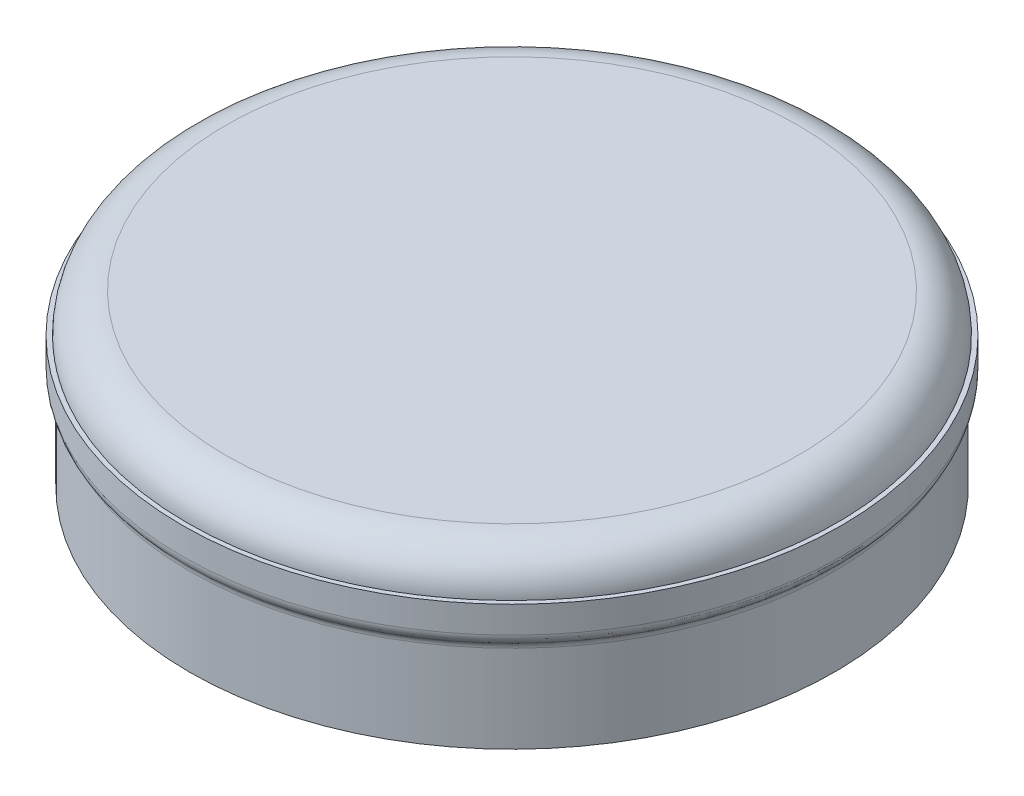
ISO-10303-21;
HEADER;
FILE_DESCRIPTION(('STEP AP214'),'2;1');
FILE_NAME('part.step','',(''),(''),'','','');
FILE_SCHEMA(('AUTOMOTIVE_DESIGN { 1 0 10303 214 1 1 1 1 }'));
ENDSEC;
DATA;
#1=APPLICATION_CONTEXT('core data for automotive mechanical design processes');
#2=APPLICATION_PROTOCOL_DEFINITION('international standard','automotive_design',2000,#1);
#3=PRODUCT_CONTEXT('',#1,'mechanical');
#4=PRODUCT('Part','Part','',(#3));
#5=PRODUCT_RELATED_PRODUCT_CATEGORY('part','',(#4));
#6=PRODUCT_DEFINITION_FORMATION('','',#4);
#7=PRODUCT_DEFINITION_CONTEXT('part definition',#1,'design');
#8=PRODUCT_DEFINITION('design','',#6,#7);
#9=PRODUCT_DEFINITION_SHAPE('','',#8);
#10=(LENGTH_UNIT() NAMED_UNIT(*) SI_UNIT(.MILLI.,.METRE.));
#11=(NAMED_UNIT(*) PLANE_ANGLE_UNIT() SI_UNIT($,.RADIAN.));
#12=(NAMED_UNIT(*) SI_UNIT($,.STERADIAN.) SOLID_ANGLE_UNIT());
#13=UNCERTAINTY_MEASURE_WITH_UNIT(LENGTH_MEASURE(1.E-05),#10,'distance_accuracy_value','');
#14=(GEOMETRIC_REPRESENTATION_CONTEXT(3) GLOBAL_UNCERTAINTY_ASSIGNED_CONTEXT((#13)) GLOBAL_UNIT_ASSIGNED_CONTEXT((#10,
#11,#12)) REPRESENTATION_CONTEXT('',''));
#15=CARTESIAN_POINT('',(0.,0.,0.));
#16=DIRECTION('',(0.,0.,1.));
#17=DIRECTION('',(1.,0.,0.));
#18=AXIS2_PLACEMENT_3D('',#15,#16,#17);
#19=CARTESIAN_POINT('',(0.,0.,0.));
#20=DIRECTION('',(0.,1.,0.));
#21=DIRECTION('',(0.,0.,1.));
#22=AXIS2_PLACEMENT_3D('',#19,#20,#21);
#23=CYLINDRICAL_SURFACE('',#22,9.017);
#24=CARTESIAN_POINT('',(0.,-1.82256044475423,0.));
#25=DIRECTION('',(0.,1.,0.));
#26=DIRECTION('',(0.,0.,1.));
#27=AXIS2_PLACEMENT_3D('',#24,#25,#26);
#28=CIRCLE('',#27,9.017);
#29=CARTESIAN_POINT('',(0.,-1.82256044475423,9.017));
#30=VERTEX_POINT('',#29);
#31=EDGE_CURVE('P0_E75',#30,#30,#28,.F.);
#32=ORIENTED_EDGE('',*,*,#31,.T.);
#33=EDGE_LOOP('',(#32));
#34=FACE_BOUND('',#33,.T.);
#35=CARTESIAN_POINT('',(0.,-1.0795,0.));
#36=DIRECTION('',(0.,1.,0.));
#37=DIRECTION('',(0.,0.,1.));
#38=AXIS2_PLACEMENT_3D('',#35,#36,#37);
#39=CIRCLE('',#38,9.017);
#40=CARTESIAN_POINT('',(0.,-1.0795,9.017));
#41=VERTEX_POINT('',#40);
#42=EDGE_CURVE('P0_E17',#41,#41,#39,.T.);
#43=ORIENTED_EDGE('',*,*,#42,.T.);
#44=EDGE_LOOP('',(#43));
#45=FACE_BOUND('',#44,.T.);
#46=ADVANCED_FACE('P0_F14',(#34,#45),#23,.F.);
#47=CARTESIAN_POINT('',(0.,-1.82256044475423,0.));
#48=DIRECTION('',(0.,1.,0.));
#49=DIRECTION('',(0.,0.,1.));
#50=AXIS2_PLACEMENT_3D('',#47,#48,#49);
#51=TOROIDAL_SURFACE('',#50,8.763,0.254000000000002);
#52=CARTESIAN_POINT('',(0.,-2.02238605942635,0.));
#53=DIRECTION('',(0.,1.,0.));
#54=DIRECTION('',(0.,0.,1.));
#55=AXIS2_PLACEMENT_3D('',#52,#53,#54);
#56=CIRCLE('',#55,8.91979835369324);
#57=CARTESIAN_POINT('',(0.,-2.02238605942635,8.91979835369324));
#58=VERTEX_POINT('',#57);
#59=EDGE_CURVE('P0_E74',#58,#58,#56,.T.);
#60=ORIENTED_EDGE('',*,*,#59,.F.);
#61=EDGE_LOOP('',(#60));
#62=FACE_BOUND('',#61,.T.);
#63=ORIENTED_EDGE('',*,*,#31,.F.);
#64=EDGE_LOOP('',(#63));
#65=FACE_BOUND('',#64,.T.);
#66=ADVANCED_FACE('P0_F67',(#62,#65),#51,.F.);
#67=CARTESIAN_POINT('',(0.,-1.0795,9.144));
#68=DIRECTION('',(0.,-1.,0.));
#69=DIRECTION('',(0.,0.,-1.));
#70=AXIS2_PLACEMENT_3D('',#67,#68,#69);
#71=PLANE('',#70);
#72=CARTESIAN_POINT('',(0.,-1.0795,0.));
#73=DIRECTION('',(0.,1.,0.));
#74=DIRECTION('',(0.,0.,1.));
#75=AXIS2_PLACEMENT_3D('',#72,#73,#74);
#76=CIRCLE('',#75,9.144);
#77=CARTESIAN_POINT('',(0.,-1.0795,9.144));
#78=VERTEX_POINT('',#77);
#79=EDGE_CURVE('P0_E55',#78,#78,#76,.F.);
#80=ORIENTED_EDGE('',*,*,#79,.F.);
#81=EDGE_LOOP('',(#80));
#82=FACE_BOUND('',#81,.T.);
#83=ORIENTED_EDGE('',*,*,#42,.F.);
#84=EDGE_LOOP('',(#83));
#85=FACE_BOUND('',#84,.T.);
#86=ADVANCED_FACE('P0_F64',(#82,#85),#71,.F.);
#87=CARTESIAN_POINT('',(0.,-2.27216348577305,0.));
#88=DIRECTION('',(0.,1.,0.));
#89=DIRECTION('',(0.,0.,1.));
#90=AXIS2_PLACEMENT_3D('',#87,#88,#89);
#91=TOROIDAL_SURFACE('',#90,9.2075,0.381);
#92=CARTESIAN_POINT('',(0.,-2.27216348577305,0.));
#93=DIRECTION('',(0.,1.,0.));
#94=DIRECTION('',(0.,0.,1.));
#95=AXIS2_PLACEMENT_3D('',#92,#93,#94);
#96=CIRCLE('',#95,8.8265);
#97=CARTESIAN_POINT('',(0.,-2.27216348577305,8.8265));
#98=VERTEX_POINT('',#97);
#99=EDGE_CURVE('P0_E51',#98,#98,#96,.F.);
#100=ORIENTED_EDGE('',*,*,#99,.T.);
#101=EDGE_LOOP('',(#100));
#102=FACE_BOUND('',#101,.T.);
#103=ORIENTED_EDGE('',*,*,#59,.T.);
#104=EDGE_LOOP('',(#103));
#105=FACE_BOUND('',#104,.T.);
#106=ADVANCED_FACE('P0_F60',(#102,#105),#91,.T.);
#107=CARTESIAN_POINT('',(0.,0.,0.));
#108=DIRECTION('',(0.,1.,0.));
#109=DIRECTION('',(0.,0.,1.));
#110=AXIS2_PLACEMENT_3D('',#107,#108,#109);
#111=CYLINDRICAL_SURFACE('',#110,9.144);
#112=ORIENTED_EDGE('',*,*,#79,.T.);
#113=EDGE_LOOP('',(#112));
#114=FACE_BOUND('',#113,.T.);
#115=CARTESIAN_POINT('',(0.,-1.82256044475423,0.));
#116=DIRECTION('',(0.,1.,0.));
#117=DIRECTION('',(0.,0.,1.));
#118=AXIS2_PLACEMENT_3D('',#115,#116,#117);
#119=CIRCLE('',#118,9.144);
#120=CARTESIAN_POINT('',(0.,-1.82256044475423,9.144));
#121=VERTEX_POINT('',#120);
#122=EDGE_CURVE('P0_E54',#121,#121,#119,.F.);
#123=ORIENTED_EDGE('',*,*,#122,.F.);
#124=EDGE_LOOP('',(#123));
#125=FACE_BOUND('',#124,.T.);
#126=ADVANCED_FACE('P0_F63',(#114,#125),#111,.T.);
#127=CARTESIAN_POINT('',(0.,0.,0.));
#128=DIRECTION('',(0.,1.,0.));
#129=DIRECTION('',(0.,0.,1.));
#130=AXIS2_PLACEMENT_3D('',#127,#128,#129);
#131=CYLINDRICAL_SURFACE('',#130,8.8265);
#132=CARTESIAN_POINT('',(0.,-4.699,0.));
#133=DIRECTION('',(0.,1.,0.));
#134=DIRECTION('',(0.,0.,1.));
#135=AXIS2_PLACEMENT_3D('',#132,#133,#134);
#136=CIRCLE('',#135,8.8265);
#137=CARTESIAN_POINT('',(0.,-4.699,8.8265));
#138=VERTEX_POINT('',#137);
#139=EDGE_CURVE('P0_E78',#138,#138,#136,.F.);
#140=ORIENTED_EDGE('',*,*,#139,.T.);
#141=EDGE_LOOP('',(#140));
#142=FACE_BOUND('',#141,.T.);
#143=ORIENTED_EDGE('',*,*,#99,.F.);
#144=EDGE_LOOP('',(#143));
#145=FACE_BOUND('',#144,.T.);
#146=ADVANCED_FACE('P0_F46',(#142,#145),#131,.F.);
#147=CARTESIAN_POINT('',(0.,-1.82256044475423,0.));
#148=DIRECTION('',(0.,1.,0.));
#149=DIRECTION('',(0.,0.,1.));
#150=AXIS2_PLACEMENT_3D('',#147,#148,#149);
#151=TOROIDAL_SURFACE('',#150,8.763,0.381000000000002);
#152=ORIENTED_EDGE('',*,*,#122,.T.);
#153=EDGE_LOOP('',(#152));
#154=FACE_BOUND('',#153,.T.);
#155=CARTESIAN_POINT('',(0.,-2.11309443531717,0.));
#156=DIRECTION('',(0.,1.,0.));
#157=DIRECTION('',(0.,0.,1.));
#158=AXIS2_PLACEMENT_3D('',#155,#156,#157);
#159=CIRCLE('',#158,9.00947718013555);
#160=CARTESIAN_POINT('',(0.,-2.11309443531717,9.00947718013555));
#161=VERTEX_POINT('',#160);
#162=EDGE_CURVE('P0_E26',#161,#161,#159,.T.);
#163=ORIENTED_EDGE('',*,*,#162,.T.);
#164=EDGE_LOOP('',(#163));
#165=FACE_BOUND('',#164,.T.);
#166=ADVANCED_FACE('P0_F42',(#154,#165),#151,.T.);
#167=CARTESIAN_POINT('',(0.,-4.699,8.8265));
#168=DIRECTION('',(0.,1.,0.));
#169=DIRECTION('',(0.,0.,1.));
#170=AXIS2_PLACEMENT_3D('',#167,#168,#169);
#171=PLANE('',#170);
#172=ORIENTED_EDGE('',*,*,#139,.F.);
#173=EDGE_LOOP('',(#172));
#174=FACE_BOUND('',#173,.T.);
#175=CARTESIAN_POINT('',(0.,-4.699,0.));
#176=DIRECTION('',(0.,1.,0.));
#177=DIRECTION('',(0.,0.,1.));
#178=AXIS2_PLACEMENT_3D('',#175,#176,#177);
#179=CIRCLE('',#178,8.9535);
#180=CARTESIAN_POINT('',(0.,-4.699,8.9535));
#181=VERTEX_POINT('',#180);
#182=EDGE_CURVE('P0_E21',#181,#181,#179,.T.);
#183=ORIENTED_EDGE('',*,*,#182,.F.);
#184=EDGE_LOOP('',(#183));
#185=FACE_BOUND('',#184,.T.);
#186=ADVANCED_FACE('P0_F38',(#174,#185),#171,.F.);
#187=CARTESIAN_POINT('',(0.,-2.27216348577305,0.));
#188=DIRECTION('',(0.,1.,0.));
#189=DIRECTION('',(0.,0.,1.));
#190=AXIS2_PLACEMENT_3D('',#187,#188,#189);
#191=TOROIDAL_SURFACE('',#190,9.2075,0.254);
#192=ORIENTED_EDGE('',*,*,#162,.F.);
#193=EDGE_LOOP('',(#192));
#194=FACE_BOUND('',#193,.T.);
#195=CARTESIAN_POINT('',(0.,-2.27216348577305,0.));
#196=DIRECTION('',(0.,1.,0.));
#197=DIRECTION('',(0.,0.,1.));
#198=AXIS2_PLACEMENT_3D('',#195,#196,#197);
#199=CIRCLE('',#198,8.9535);
#200=CARTESIAN_POINT('',(0.,-2.27216348577305,8.9535));
#201=VERTEX_POINT('',#200);
#202=EDGE_CURVE('P0_E10',#201,#201,#199,.F.);
#203=ORIENTED_EDGE('',*,*,#202,.F.);
#204=EDGE_LOOP('',(#203));
#205=FACE_BOUND('',#204,.T.);
#206=ADVANCED_FACE('P0_F33',(#194,#205),#191,.F.);
#207=CARTESIAN_POINT('',(0.,0.,0.));
#208=DIRECTION('',(0.,1.,0.));
#209=DIRECTION('',(0.,0.,1.));
#210=AXIS2_PLACEMENT_3D('',#207,#208,#209);
#211=CYLINDRICAL_SURFACE('',#210,8.9535);
#212=ORIENTED_EDGE('',*,*,#202,.T.);
#213=EDGE_LOOP('',(#212));
#214=FACE_BOUND('',#213,.T.);
#215=ORIENTED_EDGE('',*,*,#182,.T.);
#216=EDGE_LOOP('',(#215));
#217=FACE_BOUND('',#216,.T.);
#218=ADVANCED_FACE('P0_F37',(#214,#217),#211,.T.);
#219=CLOSED_SHELL('',(#46,#66,#86,#106,#126,#146,#166,#186,#206,#218));
#220=MANIFOLD_SOLID_BREP('P0_B1',#219);
#221=CARTESIAN_POINT('',(0.,-2.159,0.));
#222=DIRECTION('',(0.,-1.,0.));
#223=DIRECTION('',(0.,0.,-1.));
#224=AXIS2_PLACEMENT_3D('',#221,#222,#223);
#225=PLANE('',#224);
#226=CARTESIAN_POINT('',(0.,-2.159,0.));
#227=DIRECTION('',(0.,1.,0.));
#228=DIRECTION('',(0.,0.,1.));
#229=AXIS2_PLACEMENT_3D('',#226,#227,#228);
#230=CIRCLE('',#229,7.9375);
#231=CARTESIAN_POINT('',(0.,-2.159,7.9375));
#232=VERTEX_POINT('',#231);
#233=CARTESIAN_POINT('',(0.,-2.159,-7.9375));
#234=VERTEX_POINT('',#233);
#235=EDGE_CURVE('P1_E41',#232,#234,#230,.T.);
#236=ORIENTED_EDGE('',*,*,#235,.F.);
#237=CARTESIAN_POINT('',(0.,-2.159,0.));
#238=DIRECTION('',(0.,1.,0.));
#239=DIRECTION('',(0.,0.,-1.));
#240=AXIS2_PLACEMENT_3D('',#237,#238,#239);
#241=CIRCLE('',#240,7.9375);
#242=EDGE_CURVE('P1_E46',#234,#232,#241,.T.);
#243=ORIENTED_EDGE('',*,*,#242,.F.);
#244=EDGE_LOOP('',(#236,#243));
#245=FACE_BOUND('',#244,.T.);
#246=ADVANCED_FACE('P1_F16',(#245),#225,.T.);
#247=CARTESIAN_POINT('',(0.,-1.0795,0.));
#248=DIRECTION('',(0.,-1.,0.));
#249=DIRECTION('',(0.,0.,-1.));
#250=AXIS2_PLACEMENT_3D('',#247,#248,#249);
#251=TOROIDAL_SURFACE('',#250,7.9375,1.0795);
#252=CARTESIAN_POINT('',(0.,0.,0.));
#253=DIRECTION('',(0.,-1.,0.));
#254=DIRECTION('',(0.,0.,-1.));
#255=AXIS2_PLACEMENT_3D('',#252,#253,#254);
#256=CIRCLE('',#255,7.9375);
#257=CARTESIAN_POINT('',(0.,0.,7.9375));
#258=VERTEX_POINT('',#257);
#259=CARTESIAN_POINT('',(0.,0.,-7.9375));
#260=VERTEX_POINT('',#259);
#261=EDGE_CURVE('P1_E27',#258,#260,#256,.F.);
#262=ORIENTED_EDGE('',*,*,#261,.F.);
#263=CARTESIAN_POINT('',(0.,0.,0.));
#264=DIRECTION('',(0.,-1.,0.));
#265=DIRECTION('',(0.,0.,1.));
#266=AXIS2_PLACEMENT_3D('',#263,#264,#265);
#267=CIRCLE('',#266,7.9375);
#268=EDGE_CURVE('P1_E11',#260,#258,#267,.F.);
#269=ORIENTED_EDGE('',*,*,#268,.F.);
#270=EDGE_LOOP('',(#262,#269));
#271=FACE_BOUND('',#270,.T.);
#272=ORIENTED_EDGE('',*,*,#242,.T.);
#273=ORIENTED_EDGE('',*,*,#235,.T.);
#274=EDGE_LOOP('',(#272,#273));
#275=FACE_BOUND('',#274,.T.);
#276=ADVANCED_FACE('P1_F51',(#271,#275),#251,.T.);
#277=CARTESIAN_POINT('',(0.,0.,-7.9375));
#278=DIRECTION('',(0.,1.,0.));
#279=DIRECTION('',(0.,0.,1.));
#280=AXIS2_PLACEMENT_3D('',#277,#278,#279);
#281=PLANE('',#280);
#282=ORIENTED_EDGE('',*,*,#261,.T.);
#283=ORIENTED_EDGE('',*,*,#268,.T.);
#284=EDGE_LOOP('',(#282,#283));
#285=FACE_BOUND('',#284,.T.);
#286=ADVANCED_FACE('P1_F68',(#285),#281,.T.);
#287=CLOSED_SHELL('',(#246,#276,#286));
#288=MANIFOLD_SOLID_BREP('P1_B1',#287);
#289=ADVANCED_BREP_SHAPE_REPRESENTATION('',(#18,#220,#288),#14);
#290=SHAPE_DEFINITION_REPRESENTATION(#9,#289);
ENDSEC;
END-ISO-10303-21;
